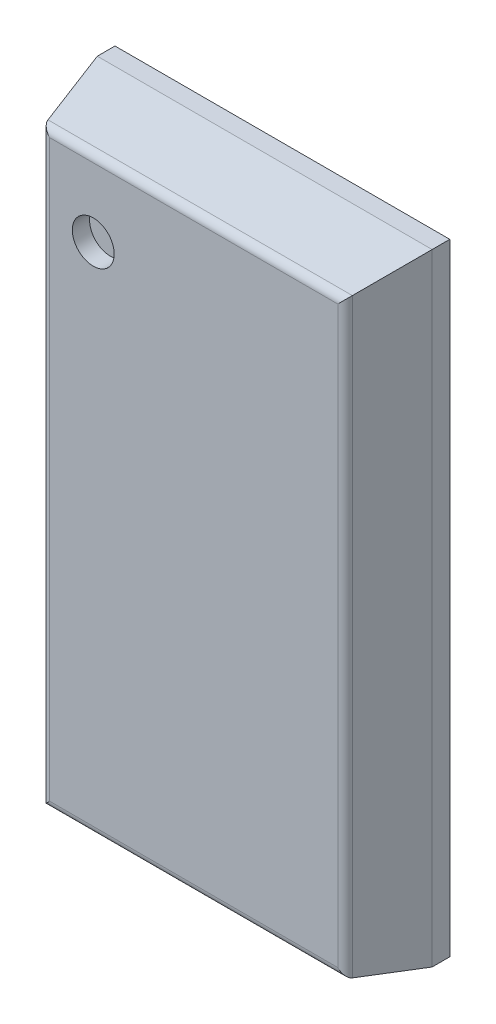
ISO-10303-21;
HEADER;
FILE_DESCRIPTION(('STEP AP214'),'2;1');
FILE_NAME('part.step','',(''),(''),'','','');
FILE_SCHEMA(('AUTOMOTIVE_DESIGN { 1 0 10303 214 1 1 1 1 }'));
ENDSEC;
DATA;
#1=APPLICATION_CONTEXT('core data for automotive mechanical design processes');
#2=APPLICATION_PROTOCOL_DEFINITION('international standard','automotive_design',2000,#1);
#3=PRODUCT_CONTEXT('',#1,'mechanical');
#4=PRODUCT('Part','Part','',(#3));
#5=PRODUCT_RELATED_PRODUCT_CATEGORY('part','',(#4));
#6=PRODUCT_DEFINITION_FORMATION('','',#4);
#7=PRODUCT_DEFINITION_CONTEXT('part definition',#1,'design');
#8=PRODUCT_DEFINITION('design','',#6,#7);
#9=PRODUCT_DEFINITION_SHAPE('','',#8);
#10=(LENGTH_UNIT() NAMED_UNIT(*) SI_UNIT(.MILLI.,.METRE.));
#11=(NAMED_UNIT(*) PLANE_ANGLE_UNIT() SI_UNIT($,.RADIAN.));
#12=(NAMED_UNIT(*) SI_UNIT($,.STERADIAN.) SOLID_ANGLE_UNIT());
#13=UNCERTAINTY_MEASURE_WITH_UNIT(LENGTH_MEASURE(1.E-05),#10,'distance_accuracy_value','');
#14=(GEOMETRIC_REPRESENTATION_CONTEXT(3) GLOBAL_UNCERTAINTY_ASSIGNED_CONTEXT((#13)) GLOBAL_UNIT_ASSIGNED_CONTEXT((#10,
#11,#12)) REPRESENTATION_CONTEXT('',''));
#15=CARTESIAN_POINT('',(0.,0.,0.));
#16=DIRECTION('',(0.,0.,1.));
#17=DIRECTION('',(1.,0.,0.));
#18=AXIS2_PLACEMENT_3D('',#15,#16,#17);
#19=CARTESIAN_POINT('',(-1.0515,2.29,1.62));
#20=DIRECTION('',(0.,0.,1.));
#21=DIRECTION('',(1.,0.,0.));
#22=AXIS2_PLACEMENT_3D('',#19,#20,#21);
#23=PLANE('',#22);
#24=CARTESIAN_POINT('',(-1.0515,2.29,1.62));
#25=DIRECTION('',(0.,0.,1.));
#26=DIRECTION('',(1.,0.,0.));
#27=AXIS2_PLACEMENT_3D('',#24,#25,#26);
#28=CIRCLE('',#27,0.2190625);
#29=CARTESIAN_POINT('',(-0.8324375,2.29,1.62));
#30=VERTEX_POINT('',#29);
#31=EDGE_CURVE('E25',#30,#30,#28,.T.);
#32=ORIENTED_EDGE('',*,*,#31,.T.);
#33=EDGE_LOOP('',(#32));
#34=FACE_BOUND('',#33,.T.);
#35=ADVANCED_FACE('F17',(#34),#23,.T.);
#36=CARTESIAN_POINT('',(-1.0515,2.29,1.62));
#37=DIRECTION('',(0.,0.,1.));
#38=DIRECTION('',(1.,0.,0.));
#39=AXIS2_PLACEMENT_3D('',#36,#37,#38);
#40=CYLINDRICAL_SURFACE('',#39,0.2190625);
#41=ORIENTED_EDGE('',*,*,#31,.F.);
#42=DIRECTION('',(0.,0.,1.));
#43=VECTOR('',#42,1.);
#44=CARTESIAN_POINT('',(-0.8324375,2.29,1.62));
#45=LINE('',#44,#43);
#46=CARTESIAN_POINT('',(-0.8324375,2.29,1.8));
#47=VERTEX_POINT('',#46);
#48=EDGE_CURVE('E11',#30,#47,#45,.T.);
#49=ORIENTED_EDGE('',*,*,#48,.T.);
#50=CARTESIAN_POINT('',(-1.0515,2.29,1.8));
#51=DIRECTION('',(0.,0.,1.));
#52=DIRECTION('',(1.,0.,0.));
#53=AXIS2_PLACEMENT_3D('',#50,#51,#52);
#54=CIRCLE('',#53,0.2190625);
#55=EDGE_CURVE('E217',#47,#47,#54,.T.);
#56=ORIENTED_EDGE('',*,*,#55,.T.);
#57=ORIENTED_EDGE('',*,*,#48,.F.);
#58=EDGE_LOOP('',(#41,#49,#56,#57));
#59=FACE_BOUND('',#58,.T.);
#60=ADVANCED_FACE('F337',(#59),#40,.F.);
#61=CARTESIAN_POINT('',(1.507884257852,-3.07725,1.712375));
#62=DIRECTION('',(0.,1.,0.));
#63=DIRECTION('',(0.,0.,1.));
#64=AXIS2_PLACEMENT_3D('',#61,#62,#63);
#65=CYLINDRICAL_SURFACE('',#64,0.087625);
#66=CARTESIAN_POINT('',(1.507884257852,-3.007884257852,1.712375));
#67=DIRECTION('',(-0.707106781186548,-0.707106781186548,0.));
#68=DIRECTION('',(0.707106781186548,-0.707106781186548,0.));
#69=AXIS2_PLACEMENT_3D('',#66,#67,#68);
#70=ELLIPSE('',#69,0.123920463403,0.087625);
#71=CARTESIAN_POINT('',(1.593170201742,-3.093170201742,1.732485902507));
#72=VERTEX_POINT('',#71);
#73=CARTESIAN_POINT('',(1.507884257852,-3.007884257852,1.8));
#74=VERTEX_POINT('',#73);
#75=EDGE_CURVE('E254',#72,#74,#70,.T.);
#76=ORIENTED_EDGE('',*,*,#75,.F.);
#77=DIRECTION('',(0.,1.,0.));
#78=VECTOR('',#77,1.);
#79=CARTESIAN_POINT('',(1.593170201742,-3.07725,1.732485902507));
#80=LINE('',#79,#78);
#81=CARTESIAN_POINT('',(1.593170201742,3.093170201742,1.732485902507));
#82=VERTEX_POINT('',#81);
#83=EDGE_CURVE('E322',#72,#82,#80,.T.);
#84=ORIENTED_EDGE('',*,*,#83,.T.);
#85=CARTESIAN_POINT('',(1.507884257852,3.007884257852,1.712375));
#86=DIRECTION('',(-0.707106781186548,0.707106781186548,0.));
#87=DIRECTION('',(0.707106781186548,0.707106781186548,0.));
#88=AXIS2_PLACEMENT_3D('',#85,#86,#87);
#89=ELLIPSE('',#88,0.123920463403,0.087625);
#90=CARTESIAN_POINT('',(1.507884257852,3.007884257852,1.8));
#91=VERTEX_POINT('',#90);
#92=EDGE_CURVE('E294',#91,#82,#89,.T.);
#93=ORIENTED_EDGE('',*,*,#92,.F.);
#94=DIRECTION('',(0.,1.,0.));
#95=VECTOR('',#94,1.);
#96=CARTESIAN_POINT('',(1.507884257852,-3.07725,1.8));
#97=LINE('',#96,#95);
#98=EDGE_CURVE('E218',#74,#91,#97,.T.);
#99=ORIENTED_EDGE('',*,*,#98,.F.);
#100=EDGE_LOOP('',(#76,#84,#93,#99));
#101=FACE_BOUND('',#100,.T.);
#102=ADVANCED_FACE('F339',(#101),#65,.T.);
#103=CARTESIAN_POINT('',(-1.57725,3.007884257852,1.712375));
#104=DIRECTION('',(1.,0.,0.));
#105=DIRECTION('',(0.,0.,1.));
#106=AXIS2_PLACEMENT_3D('',#103,#104,#105);
#107=CYLINDRICAL_SURFACE('',#106,0.087625);
#108=DIRECTION('',(1.,0.,0.));
#109=VECTOR('',#108,1.);
#110=CARTESIAN_POINT('',(-1.57725,3.007884257852,1.8));
#111=LINE('',#110,#109);
#112=CARTESIAN_POINT('',(-1.507884257852,3.007884257852,1.8));
#113=VERTEX_POINT('',#112);
#114=EDGE_CURVE('E213',#113,#91,#111,.T.);
#115=ORIENTED_EDGE('',*,*,#114,.T.);
#116=ORIENTED_EDGE('',*,*,#92,.T.);
#117=DIRECTION('',(1.,0.,0.));
#118=VECTOR('',#117,1.);
#119=CARTESIAN_POINT('',(-1.57725,3.093170201742,1.732485902507));
#120=LINE('',#119,#118);
#121=CARTESIAN_POINT('',(-1.593170201742,3.093170201742,1.732485902507));
#122=VERTEX_POINT('',#121);
#123=EDGE_CURVE('E314',#122,#82,#120,.T.);
#124=ORIENTED_EDGE('',*,*,#123,.F.);
#125=CARTESIAN_POINT('',(-1.507884257852,3.007884257852,1.712375));
#126=DIRECTION('',(0.707106781186548,0.707106781186548,0.));
#127=DIRECTION('',(-0.707106781186548,0.707106781186548,0.));
#128=AXIS2_PLACEMENT_3D('',#125,#126,#127);
#129=ELLIPSE('',#128,0.123920463403,0.087625);
#130=EDGE_CURVE('E310',#122,#113,#129,.T.);
#131=ORIENTED_EDGE('',*,*,#130,.T.);
#132=EDGE_LOOP('',(#115,#116,#124,#131));
#133=FACE_BOUND('',#132,.T.);
#134=ADVANCED_FACE('F345',(#133),#107,.T.);
#135=CARTESIAN_POINT('',(-1.7525,-3.2525,1.8));
#136=DIRECTION('',(0.,0.,1.));
#137=DIRECTION('',(1.,0.,0.));
#138=AXIS2_PLACEMENT_3D('',#135,#136,#137);
#139=PLANE('',#138);
#140=ORIENTED_EDGE('',*,*,#55,.F.);
#141=EDGE_LOOP('',(#140));
#142=FACE_BOUND('',#141,.T.);
#143=DIRECTION('',(0.,1.,0.));
#144=VECTOR('',#143,1.);
#145=CARTESIAN_POINT('',(-1.507884257852,-3.07725,1.8));
#146=LINE('',#145,#144);
#147=CARTESIAN_POINT('',(-1.507884257852,-3.007884257852,1.8));
#148=VERTEX_POINT('',#147);
#149=EDGE_CURVE('E239',#148,#113,#146,.T.);
#150=ORIENTED_EDGE('',*,*,#149,.F.);
#151=DIRECTION('',(1.,0.,0.));
#152=VECTOR('',#151,1.);
#153=CARTESIAN_POINT('',(-1.57725,-3.007884257852,1.8));
#154=LINE('',#153,#152);
#155=EDGE_CURVE('E250',#148,#74,#154,.T.);
#156=ORIENTED_EDGE('',*,*,#155,.T.);
#157=ORIENTED_EDGE('',*,*,#98,.T.);
#158=ORIENTED_EDGE('',*,*,#114,.F.);
#159=EDGE_LOOP('',(#150,#156,#157,#158));
#160=FACE_BOUND('',#159,.T.);
#161=ADVANCED_FACE('F351',(#142,#160),#139,.T.);
#162=CARTESIAN_POINT('',(-1.57725,-3.007884257852,1.712375));
#163=DIRECTION('',(1.,0.,0.));
#164=DIRECTION('',(0.,-0.973306064374652,0.229511012919918));
#165=AXIS2_PLACEMENT_3D('',#162,#163,#164);
#166=CYLINDRICAL_SURFACE('',#165,0.087625);
#167=DIRECTION('',(1.,0.,0.));
#168=VECTOR('',#167,1.);
#169=CARTESIAN_POINT('',(-1.57725,-3.093170201742,1.732485902507));
#170=LINE('',#169,#168);
#171=CARTESIAN_POINT('',(-1.593170201742,-3.093170201742,1.732485902507));
#172=VERTEX_POINT('',#171);
#173=EDGE_CURVE('E240',#172,#72,#170,.T.);
#174=ORIENTED_EDGE('',*,*,#173,.T.);
#175=ORIENTED_EDGE('',*,*,#75,.T.);
#176=ORIENTED_EDGE('',*,*,#155,.F.);
#177=CARTESIAN_POINT('',(-1.507884257852,-3.007884257852,1.712375));
#178=DIRECTION('',(-0.707106781186548,0.707106781186548,0.));
#179=DIRECTION('',(0.707106781186548,0.707106781186548,0.));
#180=AXIS2_PLACEMENT_3D('',#177,#178,#179);
#181=ELLIPSE('',#180,0.123920463403,0.087625);
#182=EDGE_CURVE('E235',#172,#148,#181,.T.);
#183=ORIENTED_EDGE('',*,*,#182,.F.);
#184=EDGE_LOOP('',(#174,#175,#176,#183));
#185=FACE_BOUND('',#184,.T.);
#186=ADVANCED_FACE('F355',(#185),#166,.T.);
#187=CARTESIAN_POINT('',(1.664875,-3.2525,1.42840151849));
#188=DIRECTION('',(0.973306064374652,0.,0.229511012919918));
#189=DIRECTION('',(0.,-1.,0.));
#190=AXIS2_PLACEMENT_3D('',#187,#188,#189);
#191=PLANE('',#190);
#192=DIRECTION('',(-0.223695018205087,0.223695018205087,0.948641701413369));
#193=VECTOR('',#192,1.);
#194=CARTESIAN_POINT('',(1.581565552085,-3.081565552085,1.781698686428));
#195=LINE('',#194,#193);
#196=CARTESIAN_POINT('',(1.7525,-3.2525,1.056803036979));
#197=VERTEX_POINT('',#196);
#198=EDGE_CURVE('E300',#197,#72,#195,.T.);
#199=ORIENTED_EDGE('',*,*,#198,.F.);
#200=DIRECTION('',(0.,1.,0.));
#201=VECTOR('',#200,1.);
#202=CARTESIAN_POINT('',(1.7525,-3.2525,1.056803036979));
#203=LINE('',#202,#201);
#204=CARTESIAN_POINT('',(1.7525,3.2525,1.056803036979));
#205=VERTEX_POINT('',#204);
#206=EDGE_CURVE('E293',#197,#205,#203,.T.);
#207=ORIENTED_EDGE('',*,*,#206,.T.);
#208=DIRECTION('',(-0.223695018205087,-0.223695018205087,0.948641701413369));
#209=VECTOR('',#208,1.);
#210=CARTESIAN_POINT('',(1.418812204631,2.918812204631,2.471900076154));
#211=LINE('',#210,#209);
#212=EDGE_CURVE('E318',#205,#82,#211,.T.);
#213=ORIENTED_EDGE('',*,*,#212,.T.);
#214=ORIENTED_EDGE('',*,*,#83,.F.);
#215=EDGE_LOOP('',(#199,#207,#213,#214));
#216=FACE_BOUND('',#215,.T.);
#217=ADVANCED_FACE('F359',(#216),#191,.T.);
#218=CARTESIAN_POINT('',(-1.7525,3.164875,1.42840151849));
#219=DIRECTION('',(0.,0.973306064374652,0.229511012919918));
#220=DIRECTION('',(1.,0.,0.));
#221=AXIS2_PLACEMENT_3D('',#218,#219,#220);
#222=PLANE('',#221);
#223=ORIENTED_EDGE('',*,*,#123,.T.);
#224=ORIENTED_EDGE('',*,*,#212,.F.);
#225=DIRECTION('',(1.,0.,0.));
#226=VECTOR('',#225,1.);
#227=CARTESIAN_POINT('',(-1.7525,3.2525,1.056803036979));
#228=LINE('',#227,#226);
#229=CARTESIAN_POINT('',(-1.7525,3.2525,1.056803036979));
#230=VERTEX_POINT('',#229);
#231=EDGE_CURVE('E289',#230,#205,#228,.T.);
#232=ORIENTED_EDGE('',*,*,#231,.F.);
#233=DIRECTION('',(0.223695018205087,-0.223695018205087,0.948641701413369));
#234=VECTOR('',#233,1.);
#235=CARTESIAN_POINT('',(-1.506506360331,3.006506360331,2.10000832043));
#236=LINE('',#235,#234);
#237=EDGE_CURVE('E277',#230,#122,#236,.T.);
#238=ORIENTED_EDGE('',*,*,#237,.T.);
#239=EDGE_LOOP('',(#223,#224,#232,#238));
#240=FACE_BOUND('',#239,.T.);
#241=ADVANCED_FACE('F363',(#240),#222,.T.);
#242=CARTESIAN_POINT('',(-1.507884257852,-3.07725,1.712375));
#243=DIRECTION('',(0.,1.,0.));
#244=DIRECTION('',(-0.973306064374652,0.,0.229511012919918));
#245=AXIS2_PLACEMENT_3D('',#242,#243,#244);
#246=CYLINDRICAL_SURFACE('',#245,0.087625);
#247=ORIENTED_EDGE('',*,*,#182,.T.);
#248=ORIENTED_EDGE('',*,*,#149,.T.);
#249=ORIENTED_EDGE('',*,*,#130,.F.);
#250=DIRECTION('',(0.,1.,0.));
#251=VECTOR('',#250,1.);
#252=CARTESIAN_POINT('',(-1.593170201742,-3.07725,1.732485902507));
#253=LINE('',#252,#251);
#254=EDGE_CURVE('E273',#172,#122,#253,.T.);
#255=ORIENTED_EDGE('',*,*,#254,.F.);
#256=EDGE_LOOP('',(#247,#248,#249,#255));
#257=FACE_BOUND('',#256,.T.);
#258=ADVANCED_FACE('F367',(#257),#246,.T.);
#259=CARTESIAN_POINT('',(-1.7525,-3.164875,1.42840151849));
#260=DIRECTION('',(0.,0.973306064374652,-0.229511012919918));
#261=DIRECTION('',(-1.,0.,0.));
#262=AXIS2_PLACEMENT_3D('',#259,#260,#261);
#263=PLANE('',#262);
#264=DIRECTION('',(0.223695018205087,0.223695018205087,0.948641701413369));
#265=VECTOR('',#264,1.);
#266=CARTESIAN_POINT('',(-1.669259707785,-3.169259707785,1.409806930703));
#267=LINE('',#266,#265);
#268=CARTESIAN_POINT('',(-1.7525,-3.2525,1.056803036979));
#269=VERTEX_POINT('',#268);
#270=EDGE_CURVE('E281',#269,#172,#267,.T.);
#271=ORIENTED_EDGE('',*,*,#270,.F.);
#272=DIRECTION('',(1.,0.,0.));
#273=VECTOR('',#272,1.);
#274=CARTESIAN_POINT('',(-1.7525,-3.2525,1.056803036979));
#275=LINE('',#274,#273);
#276=EDGE_CURVE('E147',#269,#197,#275,.T.);
#277=ORIENTED_EDGE('',*,*,#276,.T.);
#278=ORIENTED_EDGE('',*,*,#198,.T.);
#279=ORIENTED_EDGE('',*,*,#173,.F.);
#280=EDGE_LOOP('',(#271,#277,#278,#279));
#281=FACE_BOUND('',#280,.T.);
#282=ADVANCED_FACE('F385',(#281),#263,.F.);
#283=CARTESIAN_POINT('',(1.7525,-3.2525,0.74));
#284=DIRECTION('',(1.,0.,0.));
#285=DIRECTION('',(0.,1.,0.));
#286=AXIS2_PLACEMENT_3D('',#283,#284,#285);
#287=PLANE('',#286);
#288=DIRECTION('',(0.,0.,1.));
#289=VECTOR('',#288,1.);
#290=CARTESIAN_POINT('',(1.7525,-3.2525,0.74));
#291=LINE('',#290,#289);
#292=CARTESIAN_POINT('',(1.7525,-3.2525,0.871803036979));
#293=VERTEX_POINT('',#292);
#294=EDGE_CURVE('E246',#293,#197,#291,.T.);
#295=ORIENTED_EDGE('',*,*,#294,.F.);
#296=DIRECTION('',(0.,1.,0.));
#297=VECTOR('',#296,1.);
#298=CARTESIAN_POINT('',(1.7525,-3.2525,0.871803036979));
#299=LINE('',#298,#297);
#300=CARTESIAN_POINT('',(1.7525,3.2525,0.871803036979));
#301=VERTEX_POINT('',#300);
#302=EDGE_CURVE('E258',#293,#301,#299,.T.);
#303=ORIENTED_EDGE('',*,*,#302,.T.);
#304=DIRECTION('',(0.,0.,1.));
#305=VECTOR('',#304,1.);
#306=CARTESIAN_POINT('',(1.7525,3.2525,0.74));
#307=LINE('',#306,#305);
#308=EDGE_CURVE('E285',#301,#205,#307,.T.);
#309=ORIENTED_EDGE('',*,*,#308,.T.);
#310=ORIENTED_EDGE('',*,*,#206,.F.);
#311=EDGE_LOOP('',(#295,#303,#309,#310));
#312=FACE_BOUND('',#311,.T.);
#313=ADVANCED_FACE('F373',(#312),#287,.T.);
#314=CARTESIAN_POINT('',(1.547976732908,-3.07725,0.827625));
#315=DIRECTION('',(0.,1.,0.));
#316=DIRECTION('',(0.,0.,-1.));
#317=AXIS2_PLACEMENT_3D('',#314,#315,#316);
#318=CYLINDRICAL_SURFACE('',#317,0.087625);
#319=DIRECTION('',(0.,1.,0.));
#320=VECTOR('',#319,1.);
#321=CARTESIAN_POINT('',(1.547976732908,-3.07725,0.74));
#322=LINE('',#321,#320);
#323=CARTESIAN_POINT('',(1.547976732908,-3.047976732908,0.74));
#324=VERTEX_POINT('',#323);
#325=CARTESIAN_POINT('',(1.547976732908,3.047976732908,0.74));
#326=VERTEX_POINT('',#325);
#327=EDGE_CURVE('E266',#324,#326,#322,.T.);
#328=ORIENTED_EDGE('',*,*,#327,.T.);
#329=CARTESIAN_POINT('',(1.547976732908,3.047976732908,0.827625));
#330=DIRECTION('',(0.707106781186548,-0.707106781186548,0.));
#331=DIRECTION('',(0.707106781186548,0.707106781186548,0.));
#332=AXIS2_PLACEMENT_3D('',#329,#330,#331);
#333=ELLIPSE('',#332,0.123920463403,0.087625);
#334=CARTESIAN_POINT('',(1.600645169946,3.100645169946,0.757595175176));
#335=VERTEX_POINT('',#334);
#336=EDGE_CURVE('E270',#326,#335,#333,.T.);
#337=ORIENTED_EDGE('',*,*,#336,.T.);
#338=DIRECTION('',(0.,1.,0.));
#339=VECTOR('',#338,1.);
#340=CARTESIAN_POINT('',(1.600645169946,-3.07725,0.757595175176));
#341=LINE('',#340,#339);
#342=CARTESIAN_POINT('',(1.600645169946,-3.100645169946,0.757595175176));
#343=VERTEX_POINT('',#342);
#344=EDGE_CURVE('E249',#343,#335,#341,.T.);
#345=ORIENTED_EDGE('',*,*,#344,.F.);
#346=CARTESIAN_POINT('',(1.547976732908,-3.047976732908,0.827625));
#347=DIRECTION('',(0.707106781186548,0.707106781186548,0.));
#348=DIRECTION('',(0.707106781186548,-0.707106781186548,0.));
#349=AXIS2_PLACEMENT_3D('',#346,#347,#348);
#350=ELLIPSE('',#349,0.123920463403,0.087625);
#351=EDGE_CURVE('E234',#343,#324,#350,.T.);
#352=ORIENTED_EDGE('',*,*,#351,.T.);
#353=EDGE_LOOP('',(#328,#337,#345,#352));
#354=FACE_BOUND('',#353,.T.);
#355=ADVANCED_FACE('F369',(#354),#318,.T.);
#356=CARTESIAN_POINT('',(-1.7525,3.2525,0.74));
#357=DIRECTION('',(0.,1.,0.));
#358=DIRECTION('',(1.,0.,0.));
#359=AXIS2_PLACEMENT_3D('',#356,#357,#358);
#360=PLANE('',#359);
#361=ORIENTED_EDGE('',*,*,#308,.F.);
#362=DIRECTION('',(1.,0.,0.));
#363=VECTOR('',#362,1.);
#364=CARTESIAN_POINT('',(-1.7525,3.2525,0.871803036979));
#365=LINE('',#364,#363);
#366=CARTESIAN_POINT('',(-1.7525,3.2525,0.871803036979));
#367=VERTEX_POINT('',#366);
#368=EDGE_CURVE('E153',#367,#301,#365,.T.);
#369=ORIENTED_EDGE('',*,*,#368,.F.);
#370=DIRECTION('',(0.,0.,1.));
#371=VECTOR('',#370,1.);
#372=CARTESIAN_POINT('',(-1.7525,3.2525,0.74));
#373=LINE('',#372,#371);
#374=EDGE_CURVE('E154',#367,#230,#373,.T.);
#375=ORIENTED_EDGE('',*,*,#374,.T.);
#376=ORIENTED_EDGE('',*,*,#231,.T.);
#377=EDGE_LOOP('',(#361,#369,#375,#376));
#378=FACE_BOUND('',#377,.T.);
#379=ADVANCED_FACE('F372',(#378),#360,.T.);
#380=CARTESIAN_POINT('',(-1.664875,-3.2525,1.42840151849));
#381=DIRECTION('',(0.973306064374652,0.,-0.229511012919918));
#382=DIRECTION('',(0.,-1.,0.));
#383=AXIS2_PLACEMENT_3D('',#380,#381,#382);
#384=PLANE('',#383);
#385=ORIENTED_EDGE('',*,*,#254,.T.);
#386=ORIENTED_EDGE('',*,*,#237,.F.);
#387=DIRECTION('',(0.,1.,0.));
#388=VECTOR('',#387,1.);
#389=CARTESIAN_POINT('',(-1.7525,-3.2525,1.056803036979));
#390=LINE('',#389,#388);
#391=EDGE_CURVE('E201',#269,#230,#390,.T.);
#392=ORIENTED_EDGE('',*,*,#391,.F.);
#393=ORIENTED_EDGE('',*,*,#270,.T.);
#394=EDGE_LOOP('',(#385,#386,#392,#393));
#395=FACE_BOUND('',#394,.T.);
#396=ADVANCED_FACE('F375',(#395),#384,.F.);
#397=CARTESIAN_POINT('',(-1.57725,3.047976732908,0.827625));
#398=DIRECTION('',(1.,0.,0.));
#399=DIRECTION('',(0.,0.,-1.));
#400=AXIS2_PLACEMENT_3D('',#397,#398,#399);
#401=CYLINDRICAL_SURFACE('',#400,0.087625);
#402=CARTESIAN_POINT('',(-1.547976732908,3.047976732908,0.827625));
#403=DIRECTION('',(-0.707106781186548,-0.707106781186548,0.));
#404=DIRECTION('',(-0.707106781186548,0.707106781186548,0.));
#405=AXIS2_PLACEMENT_3D('',#402,#403,#404);
#406=ELLIPSE('',#405,0.123920463403,0.087625);
#407=CARTESIAN_POINT('',(-1.600645169946,3.100645169946,0.757595175176));
#408=VERTEX_POINT('',#407);
#409=CARTESIAN_POINT('',(-1.547976732908,3.047976732908,0.74));
#410=VERTEX_POINT('',#409);
#411=EDGE_CURVE('E165',#408,#410,#406,.T.);
#412=ORIENTED_EDGE('',*,*,#411,.F.);
#413=DIRECTION('',(1.,0.,0.));
#414=VECTOR('',#413,1.);
#415=CARTESIAN_POINT('',(-1.57725,3.100645169946,0.757595175176));
#416=LINE('',#415,#414);
#417=EDGE_CURVE('E226',#408,#335,#416,.T.);
#418=ORIENTED_EDGE('',*,*,#417,.T.);
#419=ORIENTED_EDGE('',*,*,#336,.F.);
#420=DIRECTION('',(1.,0.,0.));
#421=VECTOR('',#420,1.);
#422=CARTESIAN_POINT('',(-1.57725,3.047976732908,0.74));
#423=LINE('',#422,#421);
#424=EDGE_CURVE('E262',#410,#326,#423,.T.);
#425=ORIENTED_EDGE('',*,*,#424,.F.);
#426=EDGE_LOOP('',(#412,#418,#419,#425));
#427=FACE_BOUND('',#426,.T.);
#428=ADVANCED_FACE('F378',(#427),#401,.T.);
#429=CARTESIAN_POINT('',(-1.7525,-3.2525,0.74));
#430=DIRECTION('',(0.,0.,1.));
#431=DIRECTION('',(1.,0.,0.));
#432=AXIS2_PLACEMENT_3D('',#429,#430,#431);
#433=PLANE('',#432);
#434=ORIENTED_EDGE('',*,*,#424,.T.);
#435=ORIENTED_EDGE('',*,*,#327,.F.);
#436=DIRECTION('',(1.,0.,0.));
#437=VECTOR('',#436,1.);
#438=CARTESIAN_POINT('',(-1.57725,-3.047976732908,0.74));
#439=LINE('',#438,#437);
#440=CARTESIAN_POINT('',(-1.547976732908,-3.047976732908,0.74));
#441=VERTEX_POINT('',#440);
#442=EDGE_CURVE('E230',#441,#324,#439,.T.);
#443=ORIENTED_EDGE('',*,*,#442,.F.);
#444=DIRECTION('',(0.,1.,0.));
#445=VECTOR('',#444,1.);
#446=CARTESIAN_POINT('',(-1.547976732908,-3.07725,0.74));
#447=LINE('',#446,#445);
#448=EDGE_CURVE('E195',#441,#410,#447,.T.);
#449=ORIENTED_EDGE('',*,*,#448,.T.);
#450=EDGE_LOOP('',(#434,#435,#443,#449));
#451=FACE_BOUND('',#450,.T.);
#452=ADVANCED_FACE('F389',(#451),#433,.F.);
#453=CARTESIAN_POINT('',(1.664875,-3.2525,0.80590151849));
#454=DIRECTION('',(-0.601066328540768,0.,0.799199142075692));
#455=DIRECTION('',(0.,1.,0.));
#456=AXIS2_PLACEMENT_3D('',#453,#454,#455);
#457=PLANE('',#456);
#458=ORIENTED_EDGE('',*,*,#344,.T.);
#459=DIRECTION('',(-0.624313503926429,-0.624313503926429,-0.469537322936323));
#460=VECTOR('',#459,1.);
#461=CARTESIAN_POINT('',(-0.251757228533,1.248242771467,-0.635570370199));
#462=LINE('',#461,#460);
#463=EDGE_CURVE('E190',#301,#335,#462,.T.);
#464=ORIENTED_EDGE('',*,*,#463,.F.);
#465=ORIENTED_EDGE('',*,*,#302,.F.);
#466=DIRECTION('',(-0.624313503926429,0.624313503926429,-0.469537322936323));
#467=VECTOR('',#466,1.);
#468=CARTESIAN_POINT('',(1.015961081196,-2.515961081196,0.317862572775));
#469=LINE('',#468,#467);
#470=EDGE_CURVE('E163',#293,#343,#469,.T.);
#471=ORIENTED_EDGE('',*,*,#470,.T.);
#472=EDGE_LOOP('',(#458,#464,#465,#471));
#473=FACE_BOUND('',#472,.T.);
#474=ADVANCED_FACE('F391',(#473),#457,.F.);
#475=CARTESIAN_POINT('',(-1.7525,-3.2525,0.74));
#476=DIRECTION('',(0.,1.,0.));
#477=DIRECTION('',(1.,0.,0.));
#478=AXIS2_PLACEMENT_3D('',#475,#476,#477);
#479=PLANE('',#478);
#480=ORIENTED_EDGE('',*,*,#276,.F.);
#481=DIRECTION('',(0.,0.,1.));
#482=VECTOR('',#481,1.);
#483=CARTESIAN_POINT('',(-1.7525,-3.2525,0.74));
#484=LINE('',#483,#482);
#485=CARTESIAN_POINT('',(-1.7525,-3.2525,0.871803036979));
#486=VERTEX_POINT('',#485);
#487=EDGE_CURVE('E140',#486,#269,#484,.T.);
#488=ORIENTED_EDGE('',*,*,#487,.F.);
#489=DIRECTION('',(1.,0.,0.));
#490=VECTOR('',#489,1.);
#491=CARTESIAN_POINT('',(-1.7525,-3.2525,0.871803036979));
#492=LINE('',#491,#490);
#493=EDGE_CURVE('E144',#486,#293,#492,.T.);
#494=ORIENTED_EDGE('',*,*,#493,.T.);
#495=ORIENTED_EDGE('',*,*,#294,.T.);
#496=EDGE_LOOP('',(#480,#488,#494,#495));
#497=FACE_BOUND('',#496,.T.);
#498=ADVANCED_FACE('F142',(#497),#479,.F.);
#499=CARTESIAN_POINT('',(-1.57725,-3.047976732908,0.827625));
#500=DIRECTION('',(1.,0.,0.));
#501=DIRECTION('',(0.,-0.601066328540768,-0.799199142075692));
#502=AXIS2_PLACEMENT_3D('',#499,#500,#501);
#503=CYLINDRICAL_SURFACE('',#502,0.087625);
#504=CARTESIAN_POINT('',(-1.547976732908,-3.047976732908,0.827625));
#505=DIRECTION('',(0.707106781186548,-0.707106781186548,0.));
#506=DIRECTION('',(0.707106781186548,0.707106781186548,0.));
#507=AXIS2_PLACEMENT_3D('',#504,#505,#506);
#508=ELLIPSE('',#507,0.123920463403,0.087625);
#509=CARTESIAN_POINT('',(-1.600645169946,-3.100645169946,0.757595175176));
#510=VERTEX_POINT('',#509);
#511=EDGE_CURVE('E204',#510,#441,#508,.T.);
#512=ORIENTED_EDGE('',*,*,#511,.T.);
#513=ORIENTED_EDGE('',*,*,#442,.T.);
#514=ORIENTED_EDGE('',*,*,#351,.F.);
#515=DIRECTION('',(1.,0.,0.));
#516=VECTOR('',#515,1.);
#517=CARTESIAN_POINT('',(-1.57725,-3.100645169946,0.757595175176));
#518=LINE('',#517,#516);
#519=EDGE_CURVE('E200',#510,#343,#518,.T.);
#520=ORIENTED_EDGE('',*,*,#519,.F.);
#521=EDGE_LOOP('',(#512,#513,#514,#520));
#522=FACE_BOUND('',#521,.T.);
#523=ADVANCED_FACE('F400',(#522),#503,.T.);
#524=CARTESIAN_POINT('',(-1.7525,3.164875,0.80590151849));
#525=DIRECTION('',(0.,-0.601066328540768,0.799199142075692));
#526=DIRECTION('',(-1.,0.,0.));
#527=AXIS2_PLACEMENT_3D('',#524,#525,#526);
#528=PLANE('',#527);
#529=DIRECTION('',(0.624313503926429,-0.624313503926429,-0.469537322936323));
#530=VECTOR('',#529,1.);
#531=CARTESIAN_POINT('',(-0.431310054419,1.931310054419,-0.121845164185));
#532=LINE('',#531,#530);
#533=EDGE_CURVE('E176',#367,#408,#532,.T.);
#534=ORIENTED_EDGE('',*,*,#533,.F.);
#535=ORIENTED_EDGE('',*,*,#368,.T.);
#536=ORIENTED_EDGE('',*,*,#463,.T.);
#537=ORIENTED_EDGE('',*,*,#417,.F.);
#538=EDGE_LOOP('',(#534,#535,#536,#537));
#539=FACE_BOUND('',#538,.T.);
#540=ADVANCED_FACE('F403',(#539),#528,.F.);
#541=CARTESIAN_POINT('',(-1.7525,-3.2525,0.74));
#542=DIRECTION('',(1.,0.,0.));
#543=DIRECTION('',(0.,1.,0.));
#544=AXIS2_PLACEMENT_3D('',#541,#542,#543);
#545=PLANE('',#544);
#546=ORIENTED_EDGE('',*,*,#391,.T.);
#547=ORIENTED_EDGE('',*,*,#374,.F.);
#548=DIRECTION('',(0.,1.,0.));
#549=VECTOR('',#548,1.);
#550=CARTESIAN_POINT('',(-1.7525,-3.2525,0.871803036979));
#551=LINE('',#550,#549);
#552=EDGE_CURVE('E169',#486,#367,#551,.T.);
#553=ORIENTED_EDGE('',*,*,#552,.F.);
#554=ORIENTED_EDGE('',*,*,#487,.T.);
#555=EDGE_LOOP('',(#546,#547,#553,#554));
#556=FACE_BOUND('',#555,.T.);
#557=ADVANCED_FACE('F170',(#556),#545,.F.);
#558=CARTESIAN_POINT('',(-1.547976732908,-3.07725,0.827625));
#559=DIRECTION('',(0.,1.,0.));
#560=DIRECTION('',(-0.601066328540768,0.,-0.799199142075692));
#561=AXIS2_PLACEMENT_3D('',#558,#559,#560);
#562=CYLINDRICAL_SURFACE('',#561,0.087625);
#563=DIRECTION('',(0.,1.,0.));
#564=VECTOR('',#563,1.);
#565=CARTESIAN_POINT('',(-1.600645169946,-3.07725,0.757595175176));
#566=LINE('',#565,#564);
#567=EDGE_CURVE('E181',#510,#408,#566,.T.);
#568=ORIENTED_EDGE('',*,*,#567,.T.);
#569=ORIENTED_EDGE('',*,*,#411,.T.);
#570=ORIENTED_EDGE('',*,*,#448,.F.);
#571=ORIENTED_EDGE('',*,*,#511,.F.);
#572=EDGE_LOOP('',(#568,#569,#570,#571));
#573=FACE_BOUND('',#572,.T.);
#574=ADVANCED_FACE('F410',(#573),#562,.T.);
#575=CARTESIAN_POINT('',(-1.7525,-3.164875,0.80590151849));
#576=DIRECTION('',(0.,-0.601066328540768,-0.799199142075692));
#577=DIRECTION('',(0.,-0.799199142075692,0.601066328540768));
#578=AXIS2_PLACEMENT_3D('',#575,#576,#577);
#579=PLANE('',#578);
#580=ORIENTED_EDGE('',*,*,#519,.T.);
#581=ORIENTED_EDGE('',*,*,#470,.F.);
#582=ORIENTED_EDGE('',*,*,#493,.F.);
#583=DIRECTION('',(0.624313503926429,0.624313503926429,-0.469537322936323));
#584=VECTOR('',#583,1.);
#585=CARTESIAN_POINT('',(-1.699028364148,-3.199028364148,0.83158777879));
#586=LINE('',#585,#584);
#587=EDGE_CURVE('E161',#486,#510,#586,.T.);
#588=ORIENTED_EDGE('',*,*,#587,.T.);
#589=EDGE_LOOP('',(#580,#581,#582,#588));
#590=FACE_BOUND('',#589,.T.);
#591=ADVANCED_FACE('F159',(#590),#579,.T.);
#592=CARTESIAN_POINT('',(-1.664875,-3.2525,0.80590151849));
#593=DIRECTION('',(-0.601066328540768,0.,-0.799199142075692));
#594=DIRECTION('',(-0.799199142075692,0.,0.601066328540768));
#595=AXIS2_PLACEMENT_3D('',#592,#593,#594);
#596=PLANE('',#595);
#597=ORIENTED_EDGE('',*,*,#587,.F.);
#598=ORIENTED_EDGE('',*,*,#552,.T.);
#599=ORIENTED_EDGE('',*,*,#533,.T.);
#600=ORIENTED_EDGE('',*,*,#567,.F.);
#601=EDGE_LOOP('',(#597,#598,#599,#600));
#602=FACE_BOUND('',#601,.T.);
#603=ADVANCED_FACE('F179',(#602),#596,.T.);
#604=CLOSED_SHELL('',(#35,#60,#102,#134,#161,#186,#217,#241,#258,#282,#313,#355,#379,#396,#428,
#452,#474,#498,#523,#540,#557,#574,#591,#603));
#605=MANIFOLD_SOLID_BREP('B1',#604);
#606=ADVANCED_BREP_SHAPE_REPRESENTATION('',(#18,#605),#14);
#607=SHAPE_DEFINITION_REPRESENTATION(#9,#606);
ENDSEC;
END-ISO-10303-21;
